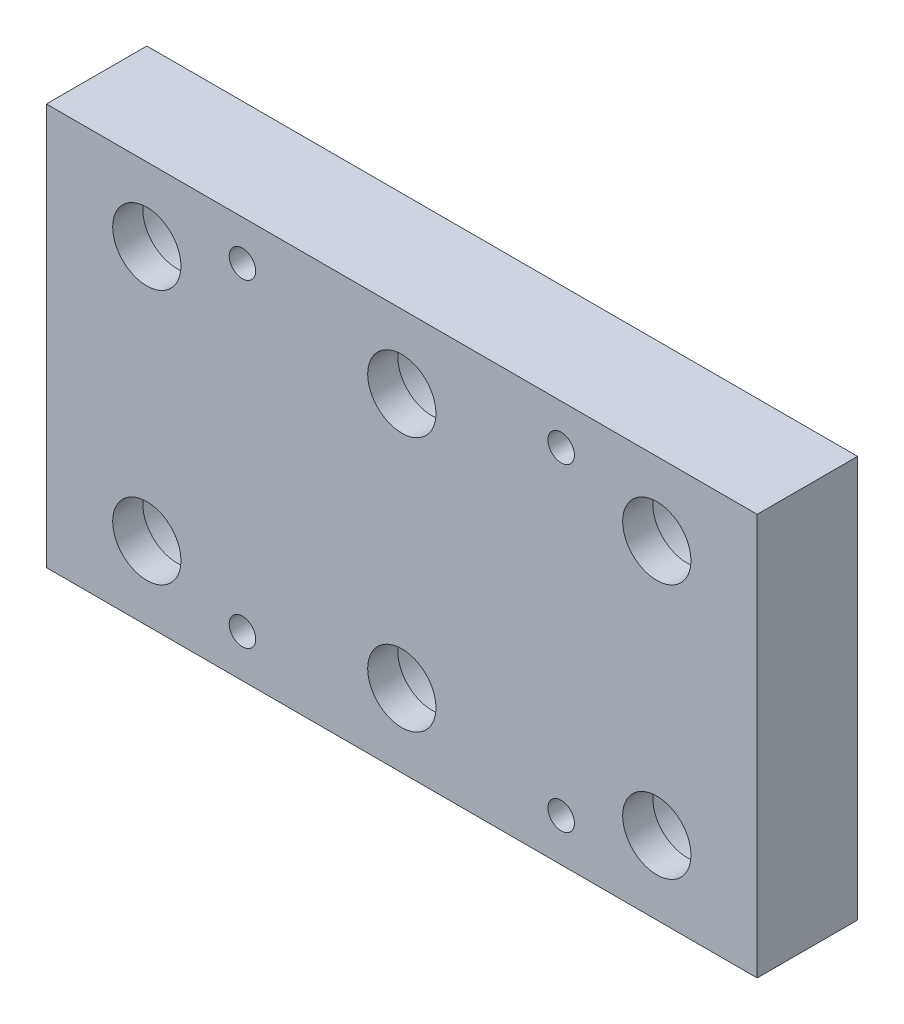
ISO-10303-21;
HEADER;
FILE_DESCRIPTION(('STEP AP214'),'2;1');
FILE_NAME('part.step','',(''),(''),'','','');
FILE_SCHEMA(('AUTOMOTIVE_DESIGN { 1 0 10303 214 1 1 1 1 }'));
ENDSEC;
DATA;
#1=APPLICATION_CONTEXT('core data for automotive mechanical design processes');
#2=APPLICATION_PROTOCOL_DEFINITION('international standard','automotive_design',2000,#1);
#3=PRODUCT_CONTEXT('',#1,'mechanical');
#4=PRODUCT('Part','Part','',(#3));
#5=PRODUCT_RELATED_PRODUCT_CATEGORY('part','',(#4));
#6=PRODUCT_DEFINITION_FORMATION('','',#4);
#7=PRODUCT_DEFINITION_CONTEXT('part definition',#1,'design');
#8=PRODUCT_DEFINITION('design','',#6,#7);
#9=PRODUCT_DEFINITION_SHAPE('','',#8);
#10=(LENGTH_UNIT() NAMED_UNIT(*) SI_UNIT(.MILLI.,.METRE.));
#11=(NAMED_UNIT(*) PLANE_ANGLE_UNIT() SI_UNIT($,.RADIAN.));
#12=(NAMED_UNIT(*) SI_UNIT($,.STERADIAN.) SOLID_ANGLE_UNIT());
#13=UNCERTAINTY_MEASURE_WITH_UNIT(LENGTH_MEASURE(1.E-05),#10,'distance_accuracy_value','');
#14=(GEOMETRIC_REPRESENTATION_CONTEXT(3) GLOBAL_UNCERTAINTY_ASSIGNED_CONTEXT((#13)) GLOBAL_UNIT_ASSIGNED_CONTEXT((#10,
#11,#12)) REPRESENTATION_CONTEXT('',''));
#15=CARTESIAN_POINT('',(0.,0.,0.));
#16=DIRECTION('',(0.,0.,1.));
#17=DIRECTION('',(1.,0.,0.));
#18=AXIS2_PLACEMENT_3D('',#15,#16,#17);
#19=CARTESIAN_POINT('',(-25.4,12.7,10.));
#20=DIRECTION('',(0.,0.,-1.));
#21=DIRECTION('',(-1.,0.,0.));
#22=AXIS2_PLACEMENT_3D('',#19,#20,#21);
#23=CYLINDRICAL_SURFACE('',#22,3.4);
#24=CARTESIAN_POINT('',(-25.4,12.7,10.));
#25=DIRECTION('',(0.,0.,-1.));
#26=DIRECTION('',(-1.,0.,0.));
#27=AXIS2_PLACEMENT_3D('',#24,#25,#26);
#28=CIRCLE('',#27,3.4);
#29=CARTESIAN_POINT('',(-28.8,12.7,10.));
#30=VERTEX_POINT('',#29);
#31=EDGE_CURVE('E165',#30,#30,#28,.T.);
#32=ORIENTED_EDGE('',*,*,#31,.F.);
#33=EDGE_LOOP('',(#32));
#34=FACE_BOUND('',#33,.T.);
#35=CARTESIAN_POINT('',(-25.4,12.7,7.));
#36=DIRECTION('',(0.,0.,-1.));
#37=DIRECTION('',(-1.,0.,0.));
#38=AXIS2_PLACEMENT_3D('',#35,#36,#37);
#39=CIRCLE('',#38,3.4);
#40=CARTESIAN_POINT('',(-28.8,12.7,7.));
#41=VERTEX_POINT('',#40);
#42=EDGE_CURVE('E39',#41,#41,#39,.F.);
#43=ORIENTED_EDGE('',*,*,#42,.F.);
#44=EDGE_LOOP('',(#43));
#45=FACE_BOUND('',#44,.T.);
#46=ADVANCED_FACE('F35',(#34,#45),#23,.F.);
#47=CARTESIAN_POINT('',(25.4,12.7,10.));
#48=DIRECTION('',(0.,0.,-1.));
#49=DIRECTION('',(-1.,0.,0.));
#50=AXIS2_PLACEMENT_3D('',#47,#48,#49);
#51=CYLINDRICAL_SURFACE('',#50,3.4);
#52=CARTESIAN_POINT('',(25.4,12.7,10.));
#53=DIRECTION('',(0.,0.,-1.));
#54=DIRECTION('',(-1.,0.,0.));
#55=AXIS2_PLACEMENT_3D('',#52,#53,#54);
#56=CIRCLE('',#55,3.4);
#57=CARTESIAN_POINT('',(22.,12.7,10.));
#58=VERTEX_POINT('',#57);
#59=EDGE_CURVE('E114',#58,#58,#56,.T.);
#60=ORIENTED_EDGE('',*,*,#59,.F.);
#61=EDGE_LOOP('',(#60));
#62=FACE_BOUND('',#61,.T.);
#63=CARTESIAN_POINT('',(25.4,12.7,7.));
#64=DIRECTION('',(0.,0.,-1.));
#65=DIRECTION('',(-1.,0.,0.));
#66=AXIS2_PLACEMENT_3D('',#63,#64,#65);
#67=CIRCLE('',#66,3.4);
#68=CARTESIAN_POINT('',(22.,12.7,7.));
#69=VERTEX_POINT('',#68);
#70=EDGE_CURVE('E130',#69,#69,#67,.F.);
#71=ORIENTED_EDGE('',*,*,#70,.F.);
#72=EDGE_LOOP('',(#71));
#73=FACE_BOUND('',#72,.T.);
#74=ADVANCED_FACE('F221',(#62,#73),#51,.F.);
#75=CARTESIAN_POINT('',(0.,12.7,10.));
#76=DIRECTION('',(0.,0.,-1.));
#77=DIRECTION('',(-1.,0.,0.));
#78=AXIS2_PLACEMENT_3D('',#75,#76,#77);
#79=CYLINDRICAL_SURFACE('',#78,3.4);
#80=CARTESIAN_POINT('',(0.,12.7,10.));
#81=DIRECTION('',(0.,0.,-1.));
#82=DIRECTION('',(-1.,0.,0.));
#83=AXIS2_PLACEMENT_3D('',#80,#81,#82);
#84=CIRCLE('',#83,3.4);
#85=CARTESIAN_POINT('',(-3.4,12.7,10.));
#86=VERTEX_POINT('',#85);
#87=EDGE_CURVE('E168',#86,#86,#84,.T.);
#88=ORIENTED_EDGE('',*,*,#87,.F.);
#89=EDGE_LOOP('',(#88));
#90=FACE_BOUND('',#89,.T.);
#91=CARTESIAN_POINT('',(0.,12.7,7.));
#92=DIRECTION('',(0.,0.,-1.));
#93=DIRECTION('',(-1.,0.,0.));
#94=AXIS2_PLACEMENT_3D('',#91,#92,#93);
#95=CIRCLE('',#94,3.4);
#96=CARTESIAN_POINT('',(-3.4,12.7,7.));
#97=VERTEX_POINT('',#96);
#98=EDGE_CURVE('E126',#97,#97,#95,.F.);
#99=ORIENTED_EDGE('',*,*,#98,.F.);
#100=EDGE_LOOP('',(#99));
#101=FACE_BOUND('',#100,.T.);
#102=ADVANCED_FACE('F227',(#90,#101),#79,.F.);
#103=CARTESIAN_POINT('',(25.4,-12.7,10.));
#104=DIRECTION('',(0.,0.,-1.));
#105=DIRECTION('',(-1.,0.,0.));
#106=AXIS2_PLACEMENT_3D('',#103,#104,#105);
#107=CYLINDRICAL_SURFACE('',#106,3.4);
#108=CARTESIAN_POINT('',(25.4,-12.7,10.));
#109=DIRECTION('',(0.,0.,-1.));
#110=DIRECTION('',(-1.,0.,0.));
#111=AXIS2_PLACEMENT_3D('',#108,#109,#110);
#112=CIRCLE('',#111,3.4);
#113=CARTESIAN_POINT('',(22.,-12.7,10.));
#114=VERTEX_POINT('',#113);
#115=EDGE_CURVE('E177',#114,#114,#112,.T.);
#116=ORIENTED_EDGE('',*,*,#115,.F.);
#117=EDGE_LOOP('',(#116));
#118=FACE_BOUND('',#117,.T.);
#119=CARTESIAN_POINT('',(25.4,-12.7,7.));
#120=DIRECTION('',(0.,0.,-1.));
#121=DIRECTION('',(-1.,0.,0.));
#122=AXIS2_PLACEMENT_3D('',#119,#120,#121);
#123=CIRCLE('',#122,3.4);
#124=CARTESIAN_POINT('',(22.,-12.7,7.));
#125=VERTEX_POINT('',#124);
#126=EDGE_CURVE('E121',#125,#125,#123,.F.);
#127=ORIENTED_EDGE('',*,*,#126,.F.);
#128=EDGE_LOOP('',(#127));
#129=FACE_BOUND('',#128,.T.);
#130=ADVANCED_FACE('F236',(#118,#129),#107,.F.);
#131=CARTESIAN_POINT('',(0.,-12.7,10.));
#132=DIRECTION('',(0.,0.,-1.));
#133=DIRECTION('',(-1.,0.,0.));
#134=AXIS2_PLACEMENT_3D('',#131,#132,#133);
#135=CYLINDRICAL_SURFACE('',#134,3.4);
#136=CARTESIAN_POINT('',(0.,-12.7,10.));
#137=DIRECTION('',(0.,0.,-1.));
#138=DIRECTION('',(-1.,0.,0.));
#139=AXIS2_PLACEMENT_3D('',#136,#137,#138);
#140=CIRCLE('',#139,3.4);
#141=CARTESIAN_POINT('',(-3.40000000000001,-12.7,10.));
#142=VERTEX_POINT('',#141);
#143=EDGE_CURVE('E174',#142,#142,#140,.T.);
#144=ORIENTED_EDGE('',*,*,#143,.F.);
#145=EDGE_LOOP('',(#144));
#146=FACE_BOUND('',#145,.T.);
#147=CARTESIAN_POINT('',(0.,-12.7,7.));
#148=DIRECTION('',(0.,0.,-1.));
#149=DIRECTION('',(-1.,0.,0.));
#150=AXIS2_PLACEMENT_3D('',#147,#148,#149);
#151=CIRCLE('',#150,3.4);
#152=CARTESIAN_POINT('',(-3.40000000000001,-12.7,7.));
#153=VERTEX_POINT('',#152);
#154=EDGE_CURVE('E116',#153,#153,#151,.F.);
#155=ORIENTED_EDGE('',*,*,#154,.F.);
#156=EDGE_LOOP('',(#155));
#157=FACE_BOUND('',#156,.T.);
#158=ADVANCED_FACE('F241',(#146,#157),#135,.F.);
#159=CARTESIAN_POINT('',(-25.4,-12.7,10.));
#160=DIRECTION('',(0.,0.,-1.));
#161=DIRECTION('',(-1.,0.,0.));
#162=AXIS2_PLACEMENT_3D('',#159,#160,#161);
#163=CYLINDRICAL_SURFACE('',#162,3.4);
#164=CARTESIAN_POINT('',(-25.4,-12.7,10.));
#165=DIRECTION('',(0.,0.,-1.));
#166=DIRECTION('',(-1.,0.,0.));
#167=AXIS2_PLACEMENT_3D('',#164,#165,#166);
#168=CIRCLE('',#167,3.4);
#169=CARTESIAN_POINT('',(-28.8,-12.7,10.));
#170=VERTEX_POINT('',#169);
#171=EDGE_CURVE('E171',#170,#170,#168,.T.);
#172=ORIENTED_EDGE('',*,*,#171,.F.);
#173=EDGE_LOOP('',(#172));
#174=FACE_BOUND('',#173,.T.);
#175=CARTESIAN_POINT('',(-25.4,-12.7,7.));
#176=DIRECTION('',(0.,0.,-1.));
#177=DIRECTION('',(-1.,0.,0.));
#178=AXIS2_PLACEMENT_3D('',#175,#176,#177);
#179=CIRCLE('',#178,3.4);
#180=CARTESIAN_POINT('',(-28.8,-12.7,7.));
#181=VERTEX_POINT('',#180);
#182=EDGE_CURVE('E111',#181,#181,#179,.F.);
#183=ORIENTED_EDGE('',*,*,#182,.F.);
#184=EDGE_LOOP('',(#183));
#185=FACE_BOUND('',#184,.T.);
#186=ADVANCED_FACE('F238',(#174,#185),#163,.F.);
#187=CARTESIAN_POINT('',(35.4,20.,10.));
#188=DIRECTION('',(-1.,0.,0.));
#189=DIRECTION('',(0.,-1.,0.));
#190=AXIS2_PLACEMENT_3D('',#187,#188,#189);
#191=PLANE('',#190);
#192=DIRECTION('',(0.,1.,0.));
#193=VECTOR('',#192,1.);
#194=CARTESIAN_POINT('',(35.4,20.,0.));
#195=LINE('',#194,#193);
#196=CARTESIAN_POINT('',(35.4,-20.,0.));
#197=VERTEX_POINT('',#196);
#198=CARTESIAN_POINT('',(35.4,20.,0.));
#199=VERTEX_POINT('',#198);
#200=EDGE_CURVE('E102',#197,#199,#195,.T.);
#201=ORIENTED_EDGE('',*,*,#200,.T.);
#202=DIRECTION('',(0.,0.,-1.));
#203=VECTOR('',#202,1.);
#204=CARTESIAN_POINT('',(35.4,20.,10.));
#205=LINE('',#204,#203);
#206=CARTESIAN_POINT('',(35.4,20.,10.));
#207=VERTEX_POINT('',#206);
#208=EDGE_CURVE('E11',#207,#199,#205,.T.);
#209=ORIENTED_EDGE('',*,*,#208,.F.);
#210=DIRECTION('',(0.,1.,0.));
#211=VECTOR('',#210,1.);
#212=CARTESIAN_POINT('',(35.4,20.,10.));
#213=LINE('',#212,#211);
#214=CARTESIAN_POINT('',(35.4,-20.,10.));
#215=VERTEX_POINT('',#214);
#216=EDGE_CURVE('E89',#215,#207,#213,.T.);
#217=ORIENTED_EDGE('',*,*,#216,.F.);
#218=DIRECTION('',(0.,0.,-1.));
#219=VECTOR('',#218,1.);
#220=CARTESIAN_POINT('',(35.4,-20.,10.));
#221=LINE('',#220,#219);
#222=EDGE_CURVE('E98',#215,#197,#221,.T.);
#223=ORIENTED_EDGE('',*,*,#222,.T.);
#224=EDGE_LOOP('',(#201,#209,#217,#223));
#225=FACE_BOUND('',#224,.T.);
#226=ADVANCED_FACE('F37',(#225),#191,.F.);
#227=CARTESIAN_POINT('',(35.4,20.,10.));
#228=DIRECTION('',(0.,-1.,0.));
#229=DIRECTION('',(1.,0.,0.));
#230=AXIS2_PLACEMENT_3D('',#227,#228,#229);
#231=PLANE('',#230);
#232=DIRECTION('',(-1.,0.,0.));
#233=VECTOR('',#232,1.);
#234=CARTESIAN_POINT('',(35.4,20.,0.));
#235=LINE('',#234,#233);
#236=CARTESIAN_POINT('',(-35.4,20.,0.));
#237=VERTEX_POINT('',#236);
#238=EDGE_CURVE('E93',#199,#237,#235,.T.);
#239=ORIENTED_EDGE('',*,*,#238,.T.);
#240=DIRECTION('',(0.,0.,-1.));
#241=VECTOR('',#240,1.);
#242=CARTESIAN_POINT('',(-35.4,20.,10.));
#243=LINE('',#242,#241);
#244=CARTESIAN_POINT('',(-35.4,20.,10.));
#245=VERTEX_POINT('',#244);
#246=EDGE_CURVE('E45',#245,#237,#243,.T.);
#247=ORIENTED_EDGE('',*,*,#246,.F.);
#248=DIRECTION('',(-1.,0.,0.));
#249=VECTOR('',#248,1.);
#250=CARTESIAN_POINT('',(35.4,20.,10.));
#251=LINE('',#250,#249);
#252=EDGE_CURVE('E84',#207,#245,#251,.T.);
#253=ORIENTED_EDGE('',*,*,#252,.F.);
#254=ORIENTED_EDGE('',*,*,#208,.T.);
#255=EDGE_LOOP('',(#239,#247,#253,#254));
#256=FACE_BOUND('',#255,.T.);
#257=ADVANCED_FACE('F92',(#256),#231,.F.);
#258=CARTESIAN_POINT('',(-35.4,20.,10.));
#259=DIRECTION('',(1.,0.,0.));
#260=DIRECTION('',(0.,1.,0.));
#261=AXIS2_PLACEMENT_3D('',#258,#259,#260);
#262=PLANE('',#261);
#263=DIRECTION('',(0.,-1.,0.));
#264=VECTOR('',#263,1.);
#265=CARTESIAN_POINT('',(-35.4,20.,0.));
#266=LINE('',#265,#264);
#267=CARTESIAN_POINT('',(-35.4,-20.,0.));
#268=VERTEX_POINT('',#267);
#269=EDGE_CURVE('E71',#237,#268,#266,.T.);
#270=ORIENTED_EDGE('',*,*,#269,.T.);
#271=DIRECTION('',(0.,0.,-1.));
#272=VECTOR('',#271,1.);
#273=CARTESIAN_POINT('',(-35.4,-20.,10.));
#274=LINE('',#273,#272);
#275=CARTESIAN_POINT('',(-35.4,-20.,10.));
#276=VERTEX_POINT('',#275);
#277=EDGE_CURVE('E94',#276,#268,#274,.T.);
#278=ORIENTED_EDGE('',*,*,#277,.F.);
#279=DIRECTION('',(0.,-1.,0.));
#280=VECTOR('',#279,1.);
#281=CARTESIAN_POINT('',(-35.4,20.,10.));
#282=LINE('',#281,#280);
#283=EDGE_CURVE('E87',#245,#276,#282,.T.);
#284=ORIENTED_EDGE('',*,*,#283,.F.);
#285=ORIENTED_EDGE('',*,*,#246,.T.);
#286=EDGE_LOOP('',(#270,#278,#284,#285));
#287=FACE_BOUND('',#286,.T.);
#288=ADVANCED_FACE('F96',(#287),#262,.F.);
#289=CARTESIAN_POINT('',(35.4,-20.,10.));
#290=DIRECTION('',(0.,1.,0.));
#291=DIRECTION('',(-1.,0.,0.));
#292=AXIS2_PLACEMENT_3D('',#289,#290,#291);
#293=PLANE('',#292);
#294=DIRECTION('',(1.,0.,0.));
#295=VECTOR('',#294,1.);
#296=CARTESIAN_POINT('',(35.4,-20.,0.));
#297=LINE('',#296,#295);
#298=EDGE_CURVE('E77',#268,#197,#297,.T.);
#299=ORIENTED_EDGE('',*,*,#298,.T.);
#300=ORIENTED_EDGE('',*,*,#222,.F.);
#301=DIRECTION('',(1.,0.,0.));
#302=VECTOR('',#301,1.);
#303=CARTESIAN_POINT('',(35.4,-20.,10.));
#304=LINE('',#303,#302);
#305=EDGE_CURVE('E54',#276,#215,#304,.T.);
#306=ORIENTED_EDGE('',*,*,#305,.F.);
#307=ORIENTED_EDGE('',*,*,#277,.T.);
#308=EDGE_LOOP('',(#299,#300,#306,#307));
#309=FACE_BOUND('',#308,.T.);
#310=ADVANCED_FACE('F208',(#309),#293,.F.);
#311=CARTESIAN_POINT('',(0.,0.,10.));
#312=DIRECTION('',(0.,0.,-1.));
#313=DIRECTION('',(-1.,0.,0.));
#314=AXIS2_PLACEMENT_3D('',#311,#312,#313);
#315=PLANE('',#314);
#316=ORIENTED_EDGE('',*,*,#59,.T.);
#317=EDGE_LOOP('',(#316));
#318=FACE_BOUND('',#317,.T.);
#319=ORIENTED_EDGE('',*,*,#31,.T.);
#320=EDGE_LOOP('',(#319));
#321=FACE_BOUND('',#320,.T.);
#322=ORIENTED_EDGE('',*,*,#87,.T.);
#323=EDGE_LOOP('',(#322));
#324=FACE_BOUND('',#323,.T.);
#325=ORIENTED_EDGE('',*,*,#171,.T.);
#326=EDGE_LOOP('',(#325));
#327=FACE_BOUND('',#326,.T.);
#328=ORIENTED_EDGE('',*,*,#143,.T.);
#329=EDGE_LOOP('',(#328));
#330=FACE_BOUND('',#329,.T.);
#331=ORIENTED_EDGE('',*,*,#115,.T.);
#332=EDGE_LOOP('',(#331));
#333=FACE_BOUND('',#332,.T.);
#334=CARTESIAN_POINT('',(15.875,16.,10.));
#335=DIRECTION('',(0.,0.,1.));
#336=DIRECTION('',(1.,0.,0.));
#337=AXIS2_PLACEMENT_3D('',#334,#335,#336);
#338=CIRCLE('',#337,1.32);
#339=CARTESIAN_POINT('',(17.195,16.,10.));
#340=VERTEX_POINT('',#339);
#341=EDGE_CURVE('E180',#340,#340,#338,.T.);
#342=ORIENTED_EDGE('',*,*,#341,.F.);
#343=EDGE_LOOP('',(#342));
#344=FACE_BOUND('',#343,.T.);
#345=CARTESIAN_POINT('',(-15.875,16.,10.));
#346=DIRECTION('',(0.,0.,1.));
#347=DIRECTION('',(1.,0.,0.));
#348=AXIS2_PLACEMENT_3D('',#345,#346,#347);
#349=CIRCLE('',#348,1.32);
#350=CARTESIAN_POINT('',(-14.555,16.,10.));
#351=VERTEX_POINT('',#350);
#352=EDGE_CURVE('E184',#351,#351,#349,.T.);
#353=ORIENTED_EDGE('',*,*,#352,.F.);
#354=EDGE_LOOP('',(#353));
#355=FACE_BOUND('',#354,.T.);
#356=CARTESIAN_POINT('',(-15.875,-15.7499999999998,10.));
#357=DIRECTION('',(0.,0.,1.));
#358=DIRECTION('',(1.,0.,0.));
#359=AXIS2_PLACEMENT_3D('',#356,#357,#358);
#360=CIRCLE('',#359,1.31999999999994);
#361=CARTESIAN_POINT('',(-14.5550000000001,-15.7499999999998,10.));
#362=VERTEX_POINT('',#361);
#363=EDGE_CURVE('E190',#362,#362,#360,.T.);
#364=ORIENTED_EDGE('',*,*,#363,.F.);
#365=EDGE_LOOP('',(#364));
#366=FACE_BOUND('',#365,.T.);
#367=CARTESIAN_POINT('',(15.875,-15.7499999999998,10.));
#368=DIRECTION('',(0.,0.,1.));
#369=DIRECTION('',(1.,0.,0.));
#370=AXIS2_PLACEMENT_3D('',#367,#368,#369);
#371=CIRCLE('',#370,1.32);
#372=CARTESIAN_POINT('',(17.195,-15.7499999999998,10.));
#373=VERTEX_POINT('',#372);
#374=EDGE_CURVE('E196',#373,#373,#371,.T.);
#375=ORIENTED_EDGE('',*,*,#374,.F.);
#376=EDGE_LOOP('',(#375));
#377=FACE_BOUND('',#376,.T.);
#378=ORIENTED_EDGE('',*,*,#216,.T.);
#379=ORIENTED_EDGE('',*,*,#252,.T.);
#380=ORIENTED_EDGE('',*,*,#283,.T.);
#381=ORIENTED_EDGE('',*,*,#305,.T.);
#382=EDGE_LOOP('',(#378,#379,#380,#381));
#383=FACE_BOUND('',#382,.T.);
#384=ADVANCED_FACE('F85',(#318,#321,#324,#327,#330,#333,#344,#355,#366,#377,#383),#315,.F.);
#385=CARTESIAN_POINT('',(0.,0.,0.));
#386=DIRECTION('',(0.,0.,-1.));
#387=DIRECTION('',(-1.,0.,0.));
#388=AXIS2_PLACEMENT_3D('',#385,#386,#387);
#389=PLANE('',#388);
#390=CARTESIAN_POINT('',(-25.4,12.7,0.));
#391=DIRECTION('',(0.,0.,-1.));
#392=DIRECTION('',(-1.,0.,0.));
#393=AXIS2_PLACEMENT_3D('',#390,#391,#392);
#394=CIRCLE('',#393,5.375);
#395=CARTESIAN_POINT('',(-30.775,12.7,0.));
#396=VERTEX_POINT('',#395);
#397=EDGE_CURVE('E146',#396,#396,#394,.T.);
#398=ORIENTED_EDGE('',*,*,#397,.F.);
#399=EDGE_LOOP('',(#398));
#400=FACE_BOUND('',#399,.T.);
#401=CARTESIAN_POINT('',(25.4,12.7,0.));
#402=DIRECTION('',(0.,0.,-1.));
#403=DIRECTION('',(-1.,0.,0.));
#404=AXIS2_PLACEMENT_3D('',#401,#402,#403);
#405=CIRCLE('',#404,5.375);
#406=CARTESIAN_POINT('',(20.025,12.7,0.));
#407=VERTEX_POINT('',#406);
#408=EDGE_CURVE('E139',#407,#407,#405,.T.);
#409=ORIENTED_EDGE('',*,*,#408,.F.);
#410=EDGE_LOOP('',(#409));
#411=FACE_BOUND('',#410,.T.);
#412=CARTESIAN_POINT('',(0.,12.7,0.));
#413=DIRECTION('',(0.,0.,-1.));
#414=DIRECTION('',(-1.,0.,0.));
#415=AXIS2_PLACEMENT_3D('',#412,#413,#414);
#416=CIRCLE('',#415,5.375);
#417=CARTESIAN_POINT('',(-5.375,12.7,0.));
#418=VERTEX_POINT('',#417);
#419=EDGE_CURVE('E132',#418,#418,#416,.T.);
#420=ORIENTED_EDGE('',*,*,#419,.F.);
#421=EDGE_LOOP('',(#420));
#422=FACE_BOUND('',#421,.T.);
#423=CARTESIAN_POINT('',(25.4,-12.7,0.));
#424=DIRECTION('',(0.,0.,-1.));
#425=DIRECTION('',(-1.,0.,0.));
#426=AXIS2_PLACEMENT_3D('',#423,#424,#425);
#427=CIRCLE('',#426,5.375);
#428=CARTESIAN_POINT('',(20.025,-12.7,0.));
#429=VERTEX_POINT('',#428);
#430=EDGE_CURVE('E128',#429,#429,#427,.T.);
#431=ORIENTED_EDGE('',*,*,#430,.F.);
#432=EDGE_LOOP('',(#431));
#433=FACE_BOUND('',#432,.T.);
#434=CARTESIAN_POINT('',(0.,-12.7,0.));
#435=DIRECTION('',(0.,0.,-1.));
#436=DIRECTION('',(-1.,0.,0.));
#437=AXIS2_PLACEMENT_3D('',#434,#435,#436);
#438=CIRCLE('',#437,5.375);
#439=CARTESIAN_POINT('',(-5.375,-12.7,0.));
#440=VERTEX_POINT('',#439);
#441=EDGE_CURVE('E124',#440,#440,#438,.T.);
#442=ORIENTED_EDGE('',*,*,#441,.F.);
#443=EDGE_LOOP('',(#442));
#444=FACE_BOUND('',#443,.T.);
#445=CARTESIAN_POINT('',(-25.4,-12.7,0.));
#446=DIRECTION('',(0.,0.,-1.));
#447=DIRECTION('',(-1.,0.,0.));
#448=AXIS2_PLACEMENT_3D('',#445,#446,#447);
#449=CIRCLE('',#448,5.375);
#450=CARTESIAN_POINT('',(-30.775,-12.7,0.));
#451=VERTEX_POINT('',#450);
#452=EDGE_CURVE('E119',#451,#451,#449,.T.);
#453=ORIENTED_EDGE('',*,*,#452,.F.);
#454=EDGE_LOOP('',(#453));
#455=FACE_BOUND('',#454,.T.);
#456=CARTESIAN_POINT('',(15.875,16.,0.));
#457=DIRECTION('',(0.,0.,1.));
#458=DIRECTION('',(1.,0.,0.));
#459=AXIS2_PLACEMENT_3D('',#456,#457,#458);
#460=CIRCLE('',#459,1.32);
#461=CARTESIAN_POINT('',(17.195,16.,0.));
#462=VERTEX_POINT('',#461);
#463=EDGE_CURVE('E181',#462,#462,#460,.T.);
#464=ORIENTED_EDGE('',*,*,#463,.T.);
#465=EDGE_LOOP('',(#464));
#466=FACE_BOUND('',#465,.T.);
#467=CARTESIAN_POINT('',(-15.875,16.,0.));
#468=DIRECTION('',(0.,0.,1.));
#469=DIRECTION('',(1.,0.,0.));
#470=AXIS2_PLACEMENT_3D('',#467,#468,#469);
#471=CIRCLE('',#470,1.32);
#472=CARTESIAN_POINT('',(-14.555,16.,0.));
#473=VERTEX_POINT('',#472);
#474=EDGE_CURVE('E187',#473,#473,#471,.T.);
#475=ORIENTED_EDGE('',*,*,#474,.T.);
#476=EDGE_LOOP('',(#475));
#477=FACE_BOUND('',#476,.T.);
#478=CARTESIAN_POINT('',(-15.875,-15.7499999999998,0.));
#479=DIRECTION('',(0.,0.,1.));
#480=DIRECTION('',(1.,0.,0.));
#481=AXIS2_PLACEMENT_3D('',#478,#479,#480);
#482=CIRCLE('',#481,1.31999999999994);
#483=CARTESIAN_POINT('',(-14.5550000000001,-15.7499999999998,0.));
#484=VERTEX_POINT('',#483);
#485=EDGE_CURVE('E193',#484,#484,#482,.T.);
#486=ORIENTED_EDGE('',*,*,#485,.T.);
#487=EDGE_LOOP('',(#486));
#488=FACE_BOUND('',#487,.T.);
#489=CARTESIAN_POINT('',(15.875,-15.7499999999998,0.));
#490=DIRECTION('',(0.,0.,1.));
#491=DIRECTION('',(1.,0.,0.));
#492=AXIS2_PLACEMENT_3D('',#489,#490,#491);
#493=CIRCLE('',#492,1.32);
#494=CARTESIAN_POINT('',(17.195,-15.7499999999998,0.));
#495=VERTEX_POINT('',#494);
#496=EDGE_CURVE('E105',#495,#495,#493,.T.);
#497=ORIENTED_EDGE('',*,*,#496,.T.);
#498=EDGE_LOOP('',(#497));
#499=FACE_BOUND('',#498,.T.);
#500=ORIENTED_EDGE('',*,*,#200,.F.);
#501=ORIENTED_EDGE('',*,*,#298,.F.);
#502=ORIENTED_EDGE('',*,*,#269,.F.);
#503=ORIENTED_EDGE('',*,*,#238,.F.);
#504=EDGE_LOOP('',(#500,#501,#502,#503));
#505=FACE_BOUND('',#504,.T.);
#506=ADVANCED_FACE('F207',(#400,#411,#422,#433,#444,#455,#466,#477,#488,#499,#505),#389,.T.);
#507=CARTESIAN_POINT('',(15.875,-15.7499999999998,0.));
#508=DIRECTION('',(0.,0.,1.));
#509=DIRECTION('',(1.,0.,0.));
#510=AXIS2_PLACEMENT_3D('',#507,#508,#509);
#511=CYLINDRICAL_SURFACE('',#510,1.32);
#512=ORIENTED_EDGE('',*,*,#496,.F.);
#513=EDGE_LOOP('',(#512));
#514=FACE_BOUND('',#513,.T.);
#515=ORIENTED_EDGE('',*,*,#374,.T.);
#516=EDGE_LOOP('',(#515));
#517=FACE_BOUND('',#516,.T.);
#518=ADVANCED_FACE('F204',(#514,#517),#511,.F.);
#519=CARTESIAN_POINT('',(-15.875,-15.7499999999998,0.));
#520=DIRECTION('',(0.,0.,1.));
#521=DIRECTION('',(1.,0.,0.));
#522=AXIS2_PLACEMENT_3D('',#519,#520,#521);
#523=CYLINDRICAL_SURFACE('',#522,1.31999999999994);
#524=ORIENTED_EDGE('',*,*,#485,.F.);
#525=EDGE_LOOP('',(#524));
#526=FACE_BOUND('',#525,.T.);
#527=ORIENTED_EDGE('',*,*,#363,.T.);
#528=EDGE_LOOP('',(#527));
#529=FACE_BOUND('',#528,.T.);
#530=ADVANCED_FACE('F257',(#526,#529),#523,.F.);
#531=CARTESIAN_POINT('',(-15.875,16.,0.));
#532=DIRECTION('',(0.,0.,1.));
#533=DIRECTION('',(1.,0.,0.));
#534=AXIS2_PLACEMENT_3D('',#531,#532,#533);
#535=CYLINDRICAL_SURFACE('',#534,1.32);
#536=ORIENTED_EDGE('',*,*,#474,.F.);
#537=EDGE_LOOP('',(#536));
#538=FACE_BOUND('',#537,.T.);
#539=ORIENTED_EDGE('',*,*,#352,.T.);
#540=EDGE_LOOP('',(#539));
#541=FACE_BOUND('',#540,.T.);
#542=ADVANCED_FACE('F253',(#538,#541),#535,.F.);
#543=CARTESIAN_POINT('',(15.875,16.,0.));
#544=DIRECTION('',(0.,0.,1.));
#545=DIRECTION('',(1.,0.,0.));
#546=AXIS2_PLACEMENT_3D('',#543,#544,#545);
#547=CYLINDRICAL_SURFACE('',#546,1.32);
#548=ORIENTED_EDGE('',*,*,#463,.F.);
#549=EDGE_LOOP('',(#548));
#550=FACE_BOUND('',#549,.T.);
#551=ORIENTED_EDGE('',*,*,#341,.T.);
#552=EDGE_LOOP('',(#551));
#553=FACE_BOUND('',#552,.T.);
#554=ADVANCED_FACE('F249',(#550,#553),#547,.F.);
#555=CARTESIAN_POINT('',(-25.4,-12.7,7.));
#556=DIRECTION('',(0.,0.,-1.));
#557=DIRECTION('',(-1.,0.,0.));
#558=AXIS2_PLACEMENT_3D('',#555,#556,#557);
#559=PLANE('',#558);
#560=CARTESIAN_POINT('',(-25.4,-12.7,7.));
#561=DIRECTION('',(0.,0.,-1.));
#562=DIRECTION('',(-1.,0.,0.));
#563=AXIS2_PLACEMENT_3D('',#560,#561,#562);
#564=CIRCLE('',#563,5.375);
#565=CARTESIAN_POINT('',(-30.775,-12.7,7.));
#566=VERTEX_POINT('',#565);
#567=EDGE_CURVE('E115',#566,#566,#564,.T.);
#568=ORIENTED_EDGE('',*,*,#567,.T.);
#569=EDGE_LOOP('',(#568));
#570=FACE_BOUND('',#569,.T.);
#571=ORIENTED_EDGE('',*,*,#182,.T.);
#572=EDGE_LOOP('',(#571));
#573=FACE_BOUND('',#572,.T.);
#574=ADVANCED_FACE('F252',(#570,#573),#559,.T.);
#575=CARTESIAN_POINT('',(-25.4,-12.7,7.));
#576=DIRECTION('',(0.,0.,-1.));
#577=DIRECTION('',(-1.,0.,0.));
#578=AXIS2_PLACEMENT_3D('',#575,#576,#577);
#579=CYLINDRICAL_SURFACE('',#578,5.375);
#580=ORIENTED_EDGE('',*,*,#567,.F.);
#581=EDGE_LOOP('',(#580));
#582=FACE_BOUND('',#581,.T.);
#583=ORIENTED_EDGE('',*,*,#452,.T.);
#584=EDGE_LOOP('',(#583));
#585=FACE_BOUND('',#584,.T.);
#586=ADVANCED_FACE('F361',(#582,#585),#579,.F.);
#587=CARTESIAN_POINT('',(0.,-12.7,7.));
#588=DIRECTION('',(0.,0.,-1.));
#589=DIRECTION('',(-1.,0.,0.));
#590=AXIS2_PLACEMENT_3D('',#587,#588,#589);
#591=PLANE('',#590);
#592=CARTESIAN_POINT('',(0.,-12.7,7.));
#593=DIRECTION('',(0.,0.,-1.));
#594=DIRECTION('',(-1.,0.,0.));
#595=AXIS2_PLACEMENT_3D('',#592,#593,#594);
#596=CIRCLE('',#595,5.375);
#597=CARTESIAN_POINT('',(-5.375,-12.7,7.));
#598=VERTEX_POINT('',#597);
#599=EDGE_CURVE('E120',#598,#598,#596,.T.);
#600=ORIENTED_EDGE('',*,*,#599,.T.);
#601=EDGE_LOOP('',(#600));
#602=FACE_BOUND('',#601,.T.);
#603=ORIENTED_EDGE('',*,*,#154,.T.);
#604=EDGE_LOOP('',(#603));
#605=FACE_BOUND('',#604,.T.);
#606=ADVANCED_FACE('F371',(#602,#605),#591,.T.);
#607=CARTESIAN_POINT('',(0.,-12.7,7.));
#608=DIRECTION('',(0.,0.,-1.));
#609=DIRECTION('',(-1.,0.,0.));
#610=AXIS2_PLACEMENT_3D('',#607,#608,#609);
#611=CYLINDRICAL_SURFACE('',#610,5.375);
#612=ORIENTED_EDGE('',*,*,#599,.F.);
#613=EDGE_LOOP('',(#612));
#614=FACE_BOUND('',#613,.T.);
#615=ORIENTED_EDGE('',*,*,#441,.T.);
#616=EDGE_LOOP('',(#615));
#617=FACE_BOUND('',#616,.T.);
#618=ADVANCED_FACE('F380',(#614,#617),#611,.F.);
#619=CARTESIAN_POINT('',(25.4,-12.7,7.));
#620=DIRECTION('',(0.,0.,-1.));
#621=DIRECTION('',(-1.,0.,0.));
#622=AXIS2_PLACEMENT_3D('',#619,#620,#621);
#623=PLANE('',#622);
#624=CARTESIAN_POINT('',(25.4,-12.7,7.));
#625=DIRECTION('',(0.,0.,-1.));
#626=DIRECTION('',(-1.,0.,0.));
#627=AXIS2_PLACEMENT_3D('',#624,#625,#626);
#628=CIRCLE('',#627,5.375);
#629=CARTESIAN_POINT('',(20.025,-12.7,7.));
#630=VERTEX_POINT('',#629);
#631=EDGE_CURVE('E125',#630,#630,#628,.T.);
#632=ORIENTED_EDGE('',*,*,#631,.T.);
#633=EDGE_LOOP('',(#632));
#634=FACE_BOUND('',#633,.T.);
#635=ORIENTED_EDGE('',*,*,#126,.T.);
#636=EDGE_LOOP('',(#635));
#637=FACE_BOUND('',#636,.T.);
#638=ADVANCED_FACE('F390',(#634,#637),#623,.T.);
#639=CARTESIAN_POINT('',(25.4,-12.7,7.));
#640=DIRECTION('',(0.,0.,-1.));
#641=DIRECTION('',(-1.,0.,0.));
#642=AXIS2_PLACEMENT_3D('',#639,#640,#641);
#643=CYLINDRICAL_SURFACE('',#642,5.375);
#644=ORIENTED_EDGE('',*,*,#631,.F.);
#645=EDGE_LOOP('',(#644));
#646=FACE_BOUND('',#645,.T.);
#647=ORIENTED_EDGE('',*,*,#430,.T.);
#648=EDGE_LOOP('',(#647));
#649=FACE_BOUND('',#648,.T.);
#650=ADVANCED_FACE('F400',(#646,#649),#643,.F.);
#651=CARTESIAN_POINT('',(0.,12.7,7.));
#652=DIRECTION('',(0.,0.,-1.));
#653=DIRECTION('',(-1.,0.,0.));
#654=AXIS2_PLACEMENT_3D('',#651,#652,#653);
#655=PLANE('',#654);
#656=CARTESIAN_POINT('',(0.,12.7,7.));
#657=DIRECTION('',(0.,0.,-1.));
#658=DIRECTION('',(-1.,0.,0.));
#659=AXIS2_PLACEMENT_3D('',#656,#657,#658);
#660=CIRCLE('',#659,5.375);
#661=CARTESIAN_POINT('',(-5.375,12.7,7.));
#662=VERTEX_POINT('',#661);
#663=EDGE_CURVE('E129',#662,#662,#660,.T.);
#664=ORIENTED_EDGE('',*,*,#663,.T.);
#665=EDGE_LOOP('',(#664));
#666=FACE_BOUND('',#665,.T.);
#667=ORIENTED_EDGE('',*,*,#98,.T.);
#668=EDGE_LOOP('',(#667));
#669=FACE_BOUND('',#668,.T.);
#670=ADVANCED_FACE('F410',(#666,#669),#655,.T.);
#671=CARTESIAN_POINT('',(0.,12.7,7.));
#672=DIRECTION('',(0.,0.,-1.));
#673=DIRECTION('',(-1.,0.,0.));
#674=AXIS2_PLACEMENT_3D('',#671,#672,#673);
#675=CYLINDRICAL_SURFACE('',#674,5.375);
#676=ORIENTED_EDGE('',*,*,#663,.F.);
#677=EDGE_LOOP('',(#676));
#678=FACE_BOUND('',#677,.T.);
#679=ORIENTED_EDGE('',*,*,#419,.T.);
#680=EDGE_LOOP('',(#679));
#681=FACE_BOUND('',#680,.T.);
#682=ADVANCED_FACE('F420',(#678,#681),#675,.F.);
#683=CARTESIAN_POINT('',(25.4,12.7,7.));
#684=DIRECTION('',(0.,0.,-1.));
#685=DIRECTION('',(-1.,0.,0.));
#686=AXIS2_PLACEMENT_3D('',#683,#684,#685);
#687=PLANE('',#686);
#688=CARTESIAN_POINT('',(25.4,12.7,7.));
#689=DIRECTION('',(0.,0.,-1.));
#690=DIRECTION('',(-1.,0.,0.));
#691=AXIS2_PLACEMENT_3D('',#688,#689,#690);
#692=CIRCLE('',#691,5.375);
#693=CARTESIAN_POINT('',(20.025,12.7,7.));
#694=VERTEX_POINT('',#693);
#695=EDGE_CURVE('E133',#694,#694,#692,.T.);
#696=ORIENTED_EDGE('',*,*,#695,.T.);
#697=EDGE_LOOP('',(#696));
#698=FACE_BOUND('',#697,.T.);
#699=ORIENTED_EDGE('',*,*,#70,.T.);
#700=EDGE_LOOP('',(#699));
#701=FACE_BOUND('',#700,.T.);
#702=ADVANCED_FACE('F430',(#698,#701),#687,.T.);
#703=CARTESIAN_POINT('',(25.4,12.7,7.));
#704=DIRECTION('',(0.,0.,-1.));
#705=DIRECTION('',(-1.,0.,0.));
#706=AXIS2_PLACEMENT_3D('',#703,#704,#705);
#707=CYLINDRICAL_SURFACE('',#706,5.375);
#708=ORIENTED_EDGE('',*,*,#695,.F.);
#709=EDGE_LOOP('',(#708));
#710=FACE_BOUND('',#709,.T.);
#711=ORIENTED_EDGE('',*,*,#408,.T.);
#712=EDGE_LOOP('',(#711));
#713=FACE_BOUND('',#712,.T.);
#714=ADVANCED_FACE('F440',(#710,#713),#707,.F.);
#715=CARTESIAN_POINT('',(-25.4,12.7,7.));
#716=DIRECTION('',(0.,0.,-1.));
#717=DIRECTION('',(-1.,0.,0.));
#718=AXIS2_PLACEMENT_3D('',#715,#716,#717);
#719=PLANE('',#718);
#720=CARTESIAN_POINT('',(-25.4,12.7,7.));
#721=DIRECTION('',(0.,0.,-1.));
#722=DIRECTION('',(-1.,0.,0.));
#723=AXIS2_PLACEMENT_3D('',#720,#721,#722);
#724=CIRCLE('',#723,5.375);
#725=CARTESIAN_POINT('',(-30.775,12.7,7.));
#726=VERTEX_POINT('',#725);
#727=EDGE_CURVE('E476',#726,#726,#724,.T.);
#728=ORIENTED_EDGE('',*,*,#727,.T.);
#729=EDGE_LOOP('',(#728));
#730=FACE_BOUND('',#729,.T.);
#731=ORIENTED_EDGE('',*,*,#42,.T.);
#732=EDGE_LOOP('',(#731));
#733=FACE_BOUND('',#732,.T.);
#734=ADVANCED_FACE('F449',(#730,#733),#719,.T.);
#735=CARTESIAN_POINT('',(-25.4,12.7,7.));
#736=DIRECTION('',(0.,0.,-1.));
#737=DIRECTION('',(-1.,0.,0.));
#738=AXIS2_PLACEMENT_3D('',#735,#736,#737);
#739=CYLINDRICAL_SURFACE('',#738,5.375);
#740=ORIENTED_EDGE('',*,*,#727,.F.);
#741=EDGE_LOOP('',(#740));
#742=FACE_BOUND('',#741,.T.);
#743=ORIENTED_EDGE('',*,*,#397,.T.);
#744=EDGE_LOOP('',(#743));
#745=FACE_BOUND('',#744,.T.);
#746=ADVANCED_FACE('F459',(#742,#745),#739,.F.);
#747=CLOSED_SHELL('',(#46,#74,#102,#130,#158,#186,#226,#257,#288,#310,#384,#506,#518,#530,#542,
#554,#574,#586,#606,#618,#638,#650,#670,#682,#702,#714,#734,#746));
#748=MANIFOLD_SOLID_BREP('B2',#747);
#749=ADVANCED_BREP_SHAPE_REPRESENTATION('',(#18,#748),#14);
#750=SHAPE_DEFINITION_REPRESENTATION(#9,#749);
ENDSEC;
END-ISO-10303-21;
